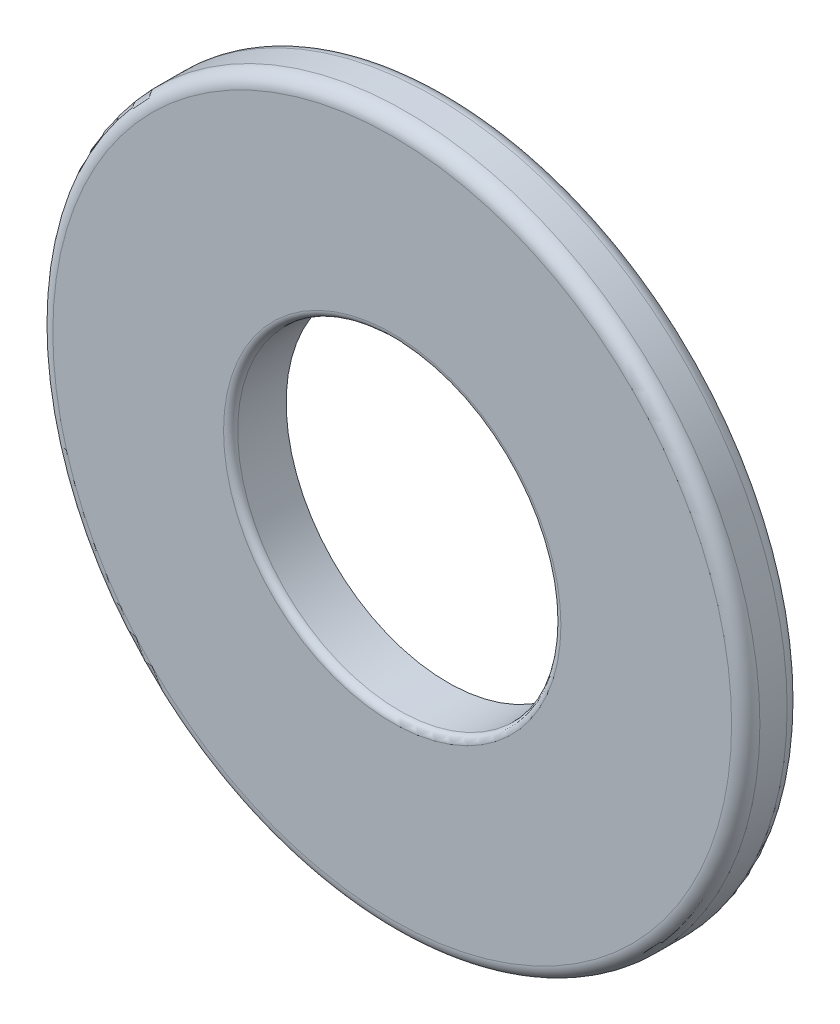
ISO-10303-21;
HEADER;
FILE_DESCRIPTION(('STEP AP214'),'2;1');
FILE_NAME('part.step','',(''),(''),'','','');
FILE_SCHEMA(('AUTOMOTIVE_DESIGN { 1 0 10303 214 1 1 1 1 }'));
ENDSEC;
DATA;
#1=APPLICATION_CONTEXT('core data for automotive mechanical design processes');
#2=APPLICATION_PROTOCOL_DEFINITION('international standard','automotive_design',2000,#1);
#3=PRODUCT_CONTEXT('',#1,'mechanical');
#4=PRODUCT('Part','Part','',(#3));
#5=PRODUCT_RELATED_PRODUCT_CATEGORY('part','',(#4));
#6=PRODUCT_DEFINITION_FORMATION('','',#4);
#7=PRODUCT_DEFINITION_CONTEXT('part definition',#1,'design');
#8=PRODUCT_DEFINITION('design','',#6,#7);
#9=PRODUCT_DEFINITION_SHAPE('','',#8);
#10=(LENGTH_UNIT() NAMED_UNIT(*) SI_UNIT(.MILLI.,.METRE.));
#11=(NAMED_UNIT(*) PLANE_ANGLE_UNIT() SI_UNIT($,.RADIAN.));
#12=(NAMED_UNIT(*) SI_UNIT($,.STERADIAN.) SOLID_ANGLE_UNIT());
#13=UNCERTAINTY_MEASURE_WITH_UNIT(LENGTH_MEASURE(1.E-05),#10,'distance_accuracy_value','');
#14=(GEOMETRIC_REPRESENTATION_CONTEXT(3) GLOBAL_UNCERTAINTY_ASSIGNED_CONTEXT((#13)) GLOBAL_UNIT_ASSIGNED_CONTEXT((#10,
#11,#12)) REPRESENTATION_CONTEXT('',''));
#15=CARTESIAN_POINT('',(0.,0.,0.));
#16=DIRECTION('',(0.,0.,1.));
#17=DIRECTION('',(1.,0.,0.));
#18=AXIS2_PLACEMENT_3D('',#15,#16,#17);
#19=CARTESIAN_POINT('',(0.,0.,-0.275));
#20=DIRECTION('',(0.,0.,1.));
#21=DIRECTION('',(1.,0.,0.));
#22=AXIS2_PLACEMENT_3D('',#19,#20,#21);
#23=CYLINDRICAL_SURFACE('',#22,3.5);
#24=CARTESIAN_POINT('',(0.,0.,0.135));
#25=DIRECTION('',(0.,0.,1.));
#26=DIRECTION('',(1.,0.,0.));
#27=AXIS2_PLACEMENT_3D('',#24,#25,#26);
#28=CIRCLE('',#27,3.5);
#29=CARTESIAN_POINT('',(3.5,0.,0.135));
#30=VERTEX_POINT('',#29);
#31=EDGE_CURVE('E96',#30,#30,#28,.F.);
#32=ORIENTED_EDGE('',*,*,#31,.T.);
#33=EDGE_LOOP('',(#32));
#34=FACE_BOUND('',#33,.T.);
#35=CARTESIAN_POINT('',(0.,0.,-0.135));
#36=DIRECTION('',(0.,0.,1.));
#37=DIRECTION('',(1.,0.,0.));
#38=AXIS2_PLACEMENT_3D('',#35,#36,#37);
#39=CIRCLE('',#38,3.5);
#40=CARTESIAN_POINT('',(3.5,0.,-0.135));
#41=VERTEX_POINT('',#40);
#42=EDGE_CURVE('E101',#41,#41,#39,.T.);
#43=ORIENTED_EDGE('',*,*,#42,.T.);
#44=EDGE_LOOP('',(#43));
#45=FACE_BOUND('',#44,.T.);
#46=ADVANCED_FACE('F81',(#34,#45),#23,.T.);
#47=CARTESIAN_POINT('',(0.,0.,-0.275));
#48=DIRECTION('',(0.,0.,1.));
#49=DIRECTION('',(1.,0.,0.));
#50=AXIS2_PLACEMENT_3D('',#47,#48,#49);
#51=PLANE('',#50);
#52=CARTESIAN_POINT('',(0.,0.,-0.275));
#53=DIRECTION('',(0.,0.,1.));
#54=DIRECTION('',(1.,0.,0.));
#55=AXIS2_PLACEMENT_3D('',#52,#53,#54);
#56=CIRCLE('',#55,3.36);
#57=CARTESIAN_POINT('',(3.36,0.,-0.275));
#58=VERTEX_POINT('',#57);
#59=EDGE_CURVE('E92',#58,#58,#56,.F.);
#60=ORIENTED_EDGE('',*,*,#59,.T.);
#61=EDGE_LOOP('',(#60));
#62=FACE_BOUND('',#61,.T.);
#63=CARTESIAN_POINT('',(0.,0.,-0.275));
#64=DIRECTION('',(0.,0.,1.));
#65=DIRECTION('',(1.,0.,0.));
#66=AXIS2_PLACEMENT_3D('',#63,#64,#65);
#67=CIRCLE('',#66,1.6);
#68=CARTESIAN_POINT('',(1.6,0.,-0.275));
#69=VERTEX_POINT('',#68);
#70=EDGE_CURVE('E107',#69,#69,#67,.T.);
#71=ORIENTED_EDGE('',*,*,#70,.T.);
#72=EDGE_LOOP('',(#71));
#73=FACE_BOUND('',#72,.T.);
#74=ADVANCED_FACE('F111',(#62,#73),#51,.F.);
#75=CARTESIAN_POINT('',(0.,0.,-0.275));
#76=DIRECTION('',(0.,0.,1.));
#77=DIRECTION('',(1.,0.,0.));
#78=AXIS2_PLACEMENT_3D('',#75,#76,#77);
#79=CYLINDRICAL_SURFACE('',#78,1.6);
#80=CARTESIAN_POINT('',(0.,0.,0.205));
#81=DIRECTION('',(0.,0.,1.));
#82=DIRECTION('',(1.,0.,0.));
#83=AXIS2_PLACEMENT_3D('',#80,#81,#82);
#84=CIRCLE('',#83,1.6);
#85=CARTESIAN_POINT('',(1.6,0.,0.205));
#86=VERTEX_POINT('',#85);
#87=EDGE_CURVE('E88',#86,#86,#84,.T.);
#88=ORIENTED_EDGE('',*,*,#87,.T.);
#89=EDGE_LOOP('',(#88));
#90=FACE_BOUND('',#89,.T.);
#91=ORIENTED_EDGE('',*,*,#70,.F.);
#92=EDGE_LOOP('',(#91));
#93=FACE_BOUND('',#92,.T.);
#94=ADVANCED_FACE('F113',(#90,#93),#79,.F.);
#95=CARTESIAN_POINT('',(0.,0.,0.275));
#96=DIRECTION('',(0.,0.,1.));
#97=DIRECTION('',(1.,0.,0.));
#98=AXIS2_PLACEMENT_3D('',#95,#96,#97);
#99=PLANE('',#98);
#100=CARTESIAN_POINT('',(0.,0.,0.275));
#101=DIRECTION('',(0.,0.,1.));
#102=DIRECTION('',(1.,0.,0.));
#103=AXIS2_PLACEMENT_3D('',#100,#101,#102);
#104=CIRCLE('',#103,1.67);
#105=CARTESIAN_POINT('',(1.67,0.,0.275));
#106=VERTEX_POINT('',#105);
#107=EDGE_CURVE('E11',#106,#106,#104,.F.);
#108=ORIENTED_EDGE('',*,*,#107,.T.);
#109=EDGE_LOOP('',(#108));
#110=FACE_BOUND('',#109,.T.);
#111=CARTESIAN_POINT('',(0.,0.,0.275));
#112=DIRECTION('',(0.,0.,1.));
#113=DIRECTION('',(1.,0.,0.));
#114=AXIS2_PLACEMENT_3D('',#111,#112,#113);
#115=CIRCLE('',#114,3.36);
#116=CARTESIAN_POINT('',(3.36,0.,0.275));
#117=VERTEX_POINT('',#116);
#118=EDGE_CURVE('E104',#117,#117,#115,.T.);
#119=ORIENTED_EDGE('',*,*,#118,.T.);
#120=EDGE_LOOP('',(#119));
#121=FACE_BOUND('',#120,.T.);
#122=ADVANCED_FACE('F115',(#110,#121),#99,.T.);
#123=CARTESIAN_POINT('',(0.,0.,0.135));
#124=DIRECTION('',(0.,0.,1.));
#125=DIRECTION('',(1.,0.,0.));
#126=AXIS2_PLACEMENT_3D('',#123,#124,#125);
#127=TOROIDAL_SURFACE('',#126,3.36,0.14);
#128=ORIENTED_EDGE('',*,*,#31,.F.);
#129=EDGE_LOOP('',(#128));
#130=FACE_BOUND('',#129,.T.);
#131=ORIENTED_EDGE('',*,*,#118,.F.);
#132=EDGE_LOOP('',(#131));
#133=FACE_BOUND('',#132,.T.);
#134=ADVANCED_FACE('F121',(#130,#133),#127,.T.);
#135=CARTESIAN_POINT('',(0.,0.,-0.135));
#136=DIRECTION('',(0.,0.,1.));
#137=DIRECTION('',(1.,0.,0.));
#138=AXIS2_PLACEMENT_3D('',#135,#136,#137);
#139=TOROIDAL_SURFACE('',#138,3.36,0.14);
#140=ORIENTED_EDGE('',*,*,#59,.F.);
#141=EDGE_LOOP('',(#140));
#142=FACE_BOUND('',#141,.T.);
#143=ORIENTED_EDGE('',*,*,#42,.F.);
#144=EDGE_LOOP('',(#143));
#145=FACE_BOUND('',#144,.T.);
#146=ADVANCED_FACE('F134',(#142,#145),#139,.T.);
#147=CARTESIAN_POINT('',(0.,0.,0.205));
#148=DIRECTION('',(0.,0.,1.));
#149=DIRECTION('',(1.,0.,0.));
#150=AXIS2_PLACEMENT_3D('',#147,#148,#149);
#151=TOROIDAL_SURFACE('',#150,1.67,0.07);
#152=ORIENTED_EDGE('',*,*,#107,.F.);
#153=EDGE_LOOP('',(#152));
#154=FACE_BOUND('',#153,.T.);
#155=ORIENTED_EDGE('',*,*,#87,.F.);
#156=EDGE_LOOP('',(#155));
#157=FACE_BOUND('',#156,.T.);
#158=ADVANCED_FACE('F83',(#154,#157),#151,.T.);
#159=CLOSED_SHELL('',(#46,#74,#94,#122,#134,#146,#158));
#160=MANIFOLD_SOLID_BREP('B2',#159);
#161=ADVANCED_BREP_SHAPE_REPRESENTATION('',(#18,#160),#14);
#162=SHAPE_DEFINITION_REPRESENTATION(#9,#161);
ENDSEC;
END-ISO-10303-21;
